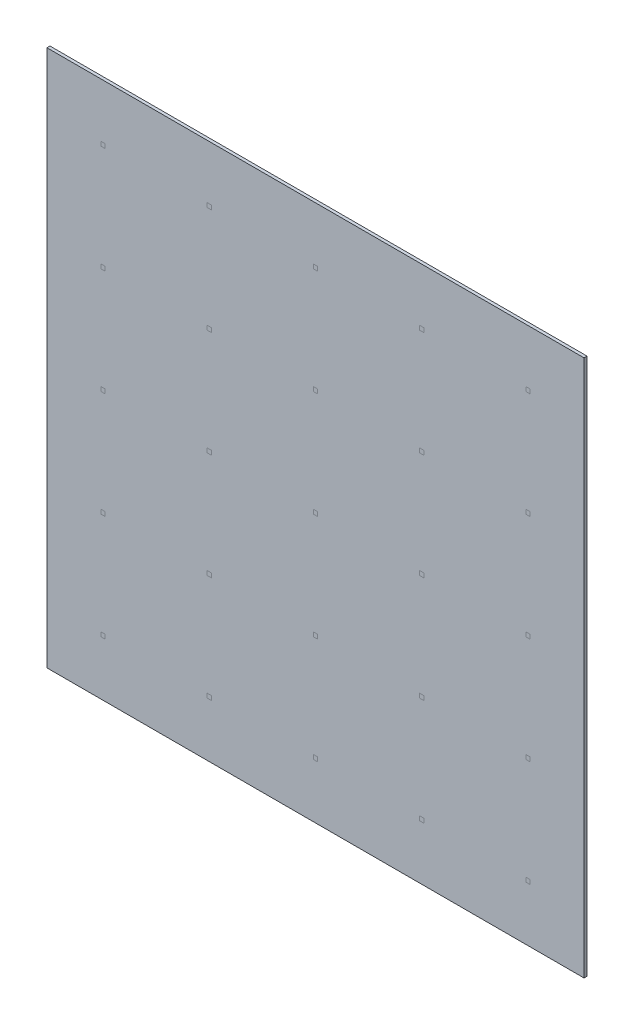
ISO-10303-21;
HEADER;
FILE_DESCRIPTION(('STEP AP214'),'2;1');
FILE_NAME('part.step','',(''),(''),'','','');
FILE_SCHEMA(('AUTOMOTIVE_DESIGN { 1 0 10303 214 1 1 1 1 }'));
ENDSEC;
DATA;
#1=APPLICATION_CONTEXT('core data for automotive mechanical design processes');
#2=APPLICATION_PROTOCOL_DEFINITION('international standard','automotive_design',2000,#1);
#3=PRODUCT_CONTEXT('',#1,'mechanical');
#4=PRODUCT('Part','Part','',(#3));
#5=PRODUCT_RELATED_PRODUCT_CATEGORY('part','',(#4));
#6=PRODUCT_DEFINITION_FORMATION('','',#4);
#7=PRODUCT_DEFINITION_CONTEXT('part definition',#1,'design');
#8=PRODUCT_DEFINITION('design','',#6,#7);
#9=PRODUCT_DEFINITION_SHAPE('','',#8);
#10=(LENGTH_UNIT() NAMED_UNIT(*) SI_UNIT(.MILLI.,.METRE.));
#11=(NAMED_UNIT(*) PLANE_ANGLE_UNIT() SI_UNIT($,.RADIAN.));
#12=(NAMED_UNIT(*) SI_UNIT($,.STERADIAN.) SOLID_ANGLE_UNIT());
#13=UNCERTAINTY_MEASURE_WITH_UNIT(LENGTH_MEASURE(1.E-05),#10,'distance_accuracy_value','');
#14=(GEOMETRIC_REPRESENTATION_CONTEXT(3) GLOBAL_UNCERTAINTY_ASSIGNED_CONTEXT((#13)) GLOBAL_UNIT_ASSIGNED_CONTEXT((#10,
#11,#12)) REPRESENTATION_CONTEXT('',''));
#15=CARTESIAN_POINT('',(0.,0.,0.));
#16=DIRECTION('',(0.,0.,1.));
#17=DIRECTION('',(1.,0.,0.));
#18=AXIS2_PLACEMENT_3D('',#15,#16,#17);
#19=CARTESIAN_POINT('',(0.,0.,0.025));
#20=DIRECTION('',(0.,0.,-1.));
#21=DIRECTION('',(-1.,0.,0.));
#22=AXIS2_PLACEMENT_3D('',#19,#20,#21);
#23=PLANE('',#22);
#24=DIRECTION('',(-1.,0.,0.));
#25=VECTOR('',#24,1.);
#26=CARTESIAN_POINT('',(0.,3.977765814,0.025));
#27=LINE('',#26,#25);
#28=CARTESIAN_POINT('',(3.09776581399999,3.977765814,0.025));
#29=VERTEX_POINT('',#28);
#30=CARTESIAN_POINT('',(3.06223418599999,3.977765814,0.025));
#31=VERTEX_POINT('',#30);
#32=EDGE_CURVE('E711',#29,#31,#27,.T.);
#33=ORIENTED_EDGE('',*,*,#32,.F.);
#34=DIRECTION('',(0.,1.,0.));
#35=VECTOR('',#34,1.);
#36=CARTESIAN_POINT('',(3.09776581399999,0.,0.025));
#37=LINE('',#36,#35);
#38=CARTESIAN_POINT('',(3.09776581399999,3.942234186,0.025));
#39=VERTEX_POINT('',#38);
#40=EDGE_CURVE('E701',#39,#29,#37,.T.);
#41=ORIENTED_EDGE('',*,*,#40,.F.);
#42=DIRECTION('',(1.,0.,0.));
#43=VECTOR('',#42,1.);
#44=CARTESIAN_POINT('',(0.,3.942234186,0.025));
#45=LINE('',#44,#43);
#46=CARTESIAN_POINT('',(3.06223418599999,3.942234186,0.025));
#47=VERTEX_POINT('',#46);
#48=EDGE_CURVE('E717',#47,#39,#45,.T.);
#49=ORIENTED_EDGE('',*,*,#48,.F.);
#50=DIRECTION('',(0.,-1.,0.));
#51=VECTOR('',#50,1.);
#52=CARTESIAN_POINT('',(3.06223418599999,0.,0.025));
#53=LINE('',#52,#51);
#54=EDGE_CURVE('E714',#31,#47,#53,.T.);
#55=ORIENTED_EDGE('',*,*,#54,.F.);
#56=EDGE_LOOP('',(#33,#41,#49,#55));
#57=FACE_BOUND('',#56,.T.);
#58=DIRECTION('',(-1.,0.,0.));
#59=VECTOR('',#58,1.);
#60=CARTESIAN_POINT('',(0.,3.977765814,0.025));
#61=LINE('',#60,#59);
#62=CARTESIAN_POINT('',(1.33776581399999,3.977765814,0.025));
#63=VERTEX_POINT('',#62);
#64=CARTESIAN_POINT('',(1.30223418599999,3.977765814,0.025));
#65=VERTEX_POINT('',#64);
#66=EDGE_CURVE('E685',#63,#65,#61,.T.);
#67=ORIENTED_EDGE('',*,*,#66,.F.);
#68=DIRECTION('',(0.,1.,0.));
#69=VECTOR('',#68,1.);
#70=CARTESIAN_POINT('',(1.33776581399999,0.,0.025));
#71=LINE('',#70,#69);
#72=CARTESIAN_POINT('',(1.33776581399999,3.942234186,0.025));
#73=VERTEX_POINT('',#72);
#74=EDGE_CURVE('E675',#73,#63,#71,.T.);
#75=ORIENTED_EDGE('',*,*,#74,.F.);
#76=DIRECTION('',(1.,0.,0.));
#77=VECTOR('',#76,1.);
#78=CARTESIAN_POINT('',(0.,3.942234186,0.025));
#79=LINE('',#78,#77);
#80=CARTESIAN_POINT('',(1.30223418599999,3.942234186,0.025));
#81=VERTEX_POINT('',#80);
#82=EDGE_CURVE('E692',#81,#73,#79,.T.);
#83=ORIENTED_EDGE('',*,*,#82,.F.);
#84=DIRECTION('',(0.,-1.,0.));
#85=VECTOR('',#84,1.);
#86=CARTESIAN_POINT('',(1.30223418599999,0.,0.025));
#87=LINE('',#86,#85);
#88=EDGE_CURVE('E689',#65,#81,#87,.T.);
#89=ORIENTED_EDGE('',*,*,#88,.F.);
#90=EDGE_LOOP('',(#67,#75,#83,#89));
#91=FACE_BOUND('',#90,.T.);
#92=DIRECTION('',(-1.,0.,0.));
#93=VECTOR('',#92,1.);
#94=CARTESIAN_POINT('',(0.,3.097765814,0.025));
#95=LINE('',#94,#93);
#96=CARTESIAN_POINT('',(3.97776581399999,3.097765814,0.025));
#97=VERTEX_POINT('',#96);
#98=CARTESIAN_POINT('',(3.94223418599999,3.097765814,0.025));
#99=VERTEX_POINT('',#98);
#100=EDGE_CURVE('E659',#97,#99,#95,.T.);
#101=ORIENTED_EDGE('',*,*,#100,.F.);
#102=DIRECTION('',(0.,1.,0.));
#103=VECTOR('',#102,1.);
#104=CARTESIAN_POINT('',(3.97776581399999,0.,0.025));
#105=LINE('',#104,#103);
#106=CARTESIAN_POINT('',(3.97776581399999,3.062234186,0.025));
#107=VERTEX_POINT('',#106);
#108=EDGE_CURVE('E649',#107,#97,#105,.T.);
#109=ORIENTED_EDGE('',*,*,#108,.F.);
#110=DIRECTION('',(1.,0.,0.));
#111=VECTOR('',#110,1.);
#112=CARTESIAN_POINT('',(0.,3.062234186,0.025));
#113=LINE('',#112,#111);
#114=CARTESIAN_POINT('',(3.94223418599999,3.062234186,0.025));
#115=VERTEX_POINT('',#114);
#116=EDGE_CURVE('E666',#115,#107,#113,.T.);
#117=ORIENTED_EDGE('',*,*,#116,.F.);
#118=DIRECTION('',(0.,-1.,0.));
#119=VECTOR('',#118,1.);
#120=CARTESIAN_POINT('',(3.94223418599999,0.,0.025));
#121=LINE('',#120,#119);
#122=EDGE_CURVE('E663',#99,#115,#121,.T.);
#123=ORIENTED_EDGE('',*,*,#122,.F.);
#124=EDGE_LOOP('',(#101,#109,#117,#123));
#125=FACE_BOUND('',#124,.T.);
#126=DIRECTION('',(-1.,0.,0.));
#127=VECTOR('',#126,1.);
#128=CARTESIAN_POINT('',(0.,3.097765814,0.025));
#129=LINE('',#128,#127);
#130=CARTESIAN_POINT('',(2.21776581399999,3.097765814,0.025));
#131=VERTEX_POINT('',#130);
#132=CARTESIAN_POINT('',(2.18223418599999,3.097765814,0.025));
#133=VERTEX_POINT('',#132);
#134=EDGE_CURVE('E633',#131,#133,#129,.T.);
#135=ORIENTED_EDGE('',*,*,#134,.F.);
#136=DIRECTION('',(0.,1.,0.));
#137=VECTOR('',#136,1.);
#138=CARTESIAN_POINT('',(2.21776581399999,0.,0.025));
#139=LINE('',#138,#137);
#140=CARTESIAN_POINT('',(2.21776581399999,3.062234186,0.025));
#141=VERTEX_POINT('',#140);
#142=EDGE_CURVE('E623',#141,#131,#139,.T.);
#143=ORIENTED_EDGE('',*,*,#142,.F.);
#144=DIRECTION('',(1.,0.,0.));
#145=VECTOR('',#144,1.);
#146=CARTESIAN_POINT('',(0.,3.062234186,0.025));
#147=LINE('',#146,#145);
#148=CARTESIAN_POINT('',(2.18223418599999,3.062234186,0.025));
#149=VERTEX_POINT('',#148);
#150=EDGE_CURVE('E640',#149,#141,#147,.T.);
#151=ORIENTED_EDGE('',*,*,#150,.F.);
#152=DIRECTION('',(0.,-1.,0.));
#153=VECTOR('',#152,1.);
#154=CARTESIAN_POINT('',(2.18223418599999,0.,0.025));
#155=LINE('',#154,#153);
#156=EDGE_CURVE('E637',#133,#149,#155,.T.);
#157=ORIENTED_EDGE('',*,*,#156,.F.);
#158=EDGE_LOOP('',(#135,#143,#151,#157));
#159=FACE_BOUND('',#158,.T.);
#160=DIRECTION('',(-1.,0.,0.));
#161=VECTOR('',#160,1.);
#162=CARTESIAN_POINT('',(0.,3.097765814,0.025));
#163=LINE('',#162,#161);
#164=CARTESIAN_POINT('',(0.457765813999991,3.097765814,0.025));
#165=VERTEX_POINT('',#164);
#166=CARTESIAN_POINT('',(0.422234185999991,3.097765814,0.025));
#167=VERTEX_POINT('',#166);
#168=EDGE_CURVE('E607',#165,#167,#163,.T.);
#169=ORIENTED_EDGE('',*,*,#168,.F.);
#170=DIRECTION('',(0.,1.,0.));
#171=VECTOR('',#170,1.);
#172=CARTESIAN_POINT('',(0.457765813999991,0.,0.025));
#173=LINE('',#172,#171);
#174=CARTESIAN_POINT('',(0.457765813999991,3.062234186,0.025));
#175=VERTEX_POINT('',#174);
#176=EDGE_CURVE('E597',#175,#165,#173,.T.);
#177=ORIENTED_EDGE('',*,*,#176,.F.);
#178=DIRECTION('',(1.,0.,0.));
#179=VECTOR('',#178,1.);
#180=CARTESIAN_POINT('',(0.,3.062234186,0.025));
#181=LINE('',#180,#179);
#182=CARTESIAN_POINT('',(0.422234185999991,3.062234186,0.025));
#183=VERTEX_POINT('',#182);
#184=EDGE_CURVE('E614',#183,#175,#181,.T.);
#185=ORIENTED_EDGE('',*,*,#184,.F.);
#186=DIRECTION('',(0.,-1.,0.));
#187=VECTOR('',#186,1.);
#188=CARTESIAN_POINT('',(0.422234185999991,0.,0.025));
#189=LINE('',#188,#187);
#190=EDGE_CURVE('E611',#167,#183,#189,.T.);
#191=ORIENTED_EDGE('',*,*,#190,.F.);
#192=EDGE_LOOP('',(#169,#177,#185,#191));
#193=FACE_BOUND('',#192,.T.);
#194=DIRECTION('',(-1.,0.,0.));
#195=VECTOR('',#194,1.);
#196=CARTESIAN_POINT('',(0.,2.217765814,0.025));
#197=LINE('',#196,#195);
#198=CARTESIAN_POINT('',(3.09776581399999,2.217765814,0.025));
#199=VERTEX_POINT('',#198);
#200=CARTESIAN_POINT('',(3.06223418599999,2.217765814,0.025));
#201=VERTEX_POINT('',#200);
#202=EDGE_CURVE('E581',#199,#201,#197,.T.);
#203=ORIENTED_EDGE('',*,*,#202,.F.);
#204=DIRECTION('',(0.,1.,0.));
#205=VECTOR('',#204,1.);
#206=CARTESIAN_POINT('',(3.09776581399999,0.,0.025));
#207=LINE('',#206,#205);
#208=CARTESIAN_POINT('',(3.09776581399999,2.182234186,0.025));
#209=VERTEX_POINT('',#208);
#210=EDGE_CURVE('E571',#209,#199,#207,.T.);
#211=ORIENTED_EDGE('',*,*,#210,.F.);
#212=DIRECTION('',(1.,0.,0.));
#213=VECTOR('',#212,1.);
#214=CARTESIAN_POINT('',(0.,2.182234186,0.025));
#215=LINE('',#214,#213);
#216=CARTESIAN_POINT('',(3.06223418599999,2.182234186,0.025));
#217=VERTEX_POINT('',#216);
#218=EDGE_CURVE('E588',#217,#209,#215,.T.);
#219=ORIENTED_EDGE('',*,*,#218,.F.);
#220=DIRECTION('',(0.,-1.,0.));
#221=VECTOR('',#220,1.);
#222=CARTESIAN_POINT('',(3.06223418599999,0.,0.025));
#223=LINE('',#222,#221);
#224=EDGE_CURVE('E585',#201,#217,#223,.T.);
#225=ORIENTED_EDGE('',*,*,#224,.F.);
#226=EDGE_LOOP('',(#203,#211,#219,#225));
#227=FACE_BOUND('',#226,.T.);
#228=DIRECTION('',(-1.,0.,0.));
#229=VECTOR('',#228,1.);
#230=CARTESIAN_POINT('',(0.,2.217765814,0.025));
#231=LINE('',#230,#229);
#232=CARTESIAN_POINT('',(1.33776581399999,2.217765814,0.025));
#233=VERTEX_POINT('',#232);
#234=CARTESIAN_POINT('',(1.30223418599999,2.217765814,0.025));
#235=VERTEX_POINT('',#234);
#236=EDGE_CURVE('E555',#233,#235,#231,.T.);
#237=ORIENTED_EDGE('',*,*,#236,.F.);
#238=DIRECTION('',(0.,1.,0.));
#239=VECTOR('',#238,1.);
#240=CARTESIAN_POINT('',(1.33776581399999,0.,0.025));
#241=LINE('',#240,#239);
#242=CARTESIAN_POINT('',(1.33776581399999,2.182234186,0.025));
#243=VERTEX_POINT('',#242);
#244=EDGE_CURVE('E545',#243,#233,#241,.T.);
#245=ORIENTED_EDGE('',*,*,#244,.F.);
#246=DIRECTION('',(1.,0.,0.));
#247=VECTOR('',#246,1.);
#248=CARTESIAN_POINT('',(0.,2.182234186,0.025));
#249=LINE('',#248,#247);
#250=CARTESIAN_POINT('',(1.30223418599999,2.182234186,0.025));
#251=VERTEX_POINT('',#250);
#252=EDGE_CURVE('E562',#251,#243,#249,.T.);
#253=ORIENTED_EDGE('',*,*,#252,.F.);
#254=DIRECTION('',(0.,-1.,0.));
#255=VECTOR('',#254,1.);
#256=CARTESIAN_POINT('',(1.30223418599999,0.,0.025));
#257=LINE('',#256,#255);
#258=EDGE_CURVE('E559',#235,#251,#257,.T.);
#259=ORIENTED_EDGE('',*,*,#258,.F.);
#260=EDGE_LOOP('',(#237,#245,#253,#259));
#261=FACE_BOUND('',#260,.T.);
#262=DIRECTION('',(-1.,0.,0.));
#263=VECTOR('',#262,1.);
#264=CARTESIAN_POINT('',(0.,1.337765814,0.025));
#265=LINE('',#264,#263);
#266=CARTESIAN_POINT('',(3.977765814,1.337765814,0.025));
#267=VERTEX_POINT('',#266);
#268=CARTESIAN_POINT('',(3.942234186,1.337765814,0.025));
#269=VERTEX_POINT('',#268);
#270=EDGE_CURVE('E529',#267,#269,#265,.T.);
#271=ORIENTED_EDGE('',*,*,#270,.F.);
#272=DIRECTION('',(0.,1.,0.));
#273=VECTOR('',#272,1.);
#274=CARTESIAN_POINT('',(3.977765814,0.,0.025));
#275=LINE('',#274,#273);
#276=CARTESIAN_POINT('',(3.977765814,1.302234186,0.025));
#277=VERTEX_POINT('',#276);
#278=EDGE_CURVE('E519',#277,#267,#275,.T.);
#279=ORIENTED_EDGE('',*,*,#278,.F.);
#280=DIRECTION('',(1.,0.,0.));
#281=VECTOR('',#280,1.);
#282=CARTESIAN_POINT('',(0.,1.302234186,0.025));
#283=LINE('',#282,#281);
#284=CARTESIAN_POINT('',(3.942234186,1.302234186,0.025));
#285=VERTEX_POINT('',#284);
#286=EDGE_CURVE('E536',#285,#277,#283,.T.);
#287=ORIENTED_EDGE('',*,*,#286,.F.);
#288=DIRECTION('',(0.,-1.,0.));
#289=VECTOR('',#288,1.);
#290=CARTESIAN_POINT('',(3.942234186,0.,0.025));
#291=LINE('',#290,#289);
#292=EDGE_CURVE('E533',#269,#285,#291,.T.);
#293=ORIENTED_EDGE('',*,*,#292,.F.);
#294=EDGE_LOOP('',(#271,#279,#287,#293));
#295=FACE_BOUND('',#294,.T.);
#296=DIRECTION('',(-1.,0.,0.));
#297=VECTOR('',#296,1.);
#298=CARTESIAN_POINT('',(0.,1.337765814,0.025));
#299=LINE('',#298,#297);
#300=CARTESIAN_POINT('',(2.217765814,1.337765814,0.025));
#301=VERTEX_POINT('',#300);
#302=CARTESIAN_POINT('',(2.182234186,1.337765814,0.025));
#303=VERTEX_POINT('',#302);
#304=EDGE_CURVE('E503',#301,#303,#299,.T.);
#305=ORIENTED_EDGE('',*,*,#304,.F.);
#306=DIRECTION('',(0.,1.,0.));
#307=VECTOR('',#306,1.);
#308=CARTESIAN_POINT('',(2.217765814,0.,0.025));
#309=LINE('',#308,#307);
#310=CARTESIAN_POINT('',(2.217765814,1.302234186,0.025));
#311=VERTEX_POINT('',#310);
#312=EDGE_CURVE('E493',#311,#301,#309,.T.);
#313=ORIENTED_EDGE('',*,*,#312,.F.);
#314=DIRECTION('',(1.,0.,0.));
#315=VECTOR('',#314,1.);
#316=CARTESIAN_POINT('',(0.,1.302234186,0.025));
#317=LINE('',#316,#315);
#318=CARTESIAN_POINT('',(2.182234186,1.302234186,0.025));
#319=VERTEX_POINT('',#318);
#320=EDGE_CURVE('E510',#319,#311,#317,.T.);
#321=ORIENTED_EDGE('',*,*,#320,.F.);
#322=DIRECTION('',(0.,-1.,0.));
#323=VECTOR('',#322,1.);
#324=CARTESIAN_POINT('',(2.182234186,0.,0.025));
#325=LINE('',#324,#323);
#326=EDGE_CURVE('E507',#303,#319,#325,.T.);
#327=ORIENTED_EDGE('',*,*,#326,.F.);
#328=EDGE_LOOP('',(#305,#313,#321,#327));
#329=FACE_BOUND('',#328,.T.);
#330=DIRECTION('',(-1.,0.,0.));
#331=VECTOR('',#330,1.);
#332=CARTESIAN_POINT('',(0.,0.457765814,0.025));
#333=LINE('',#332,#331);
#334=CARTESIAN_POINT('',(3.097765814,0.457765814,0.025));
#335=VERTEX_POINT('',#334);
#336=CARTESIAN_POINT('',(3.062234186,0.457765814,0.025));
#337=VERTEX_POINT('',#336);
#338=EDGE_CURVE('E486',#335,#337,#333,.T.);
#339=ORIENTED_EDGE('',*,*,#338,.F.);
#340=DIRECTION('',(0.,1.,0.));
#341=VECTOR('',#340,1.);
#342=CARTESIAN_POINT('',(3.097765814,0.,0.025));
#343=LINE('',#342,#341);
#344=CARTESIAN_POINT('',(3.097765814,0.422234186,0.025));
#345=VERTEX_POINT('',#344);
#346=EDGE_CURVE('E476',#345,#335,#343,.T.);
#347=ORIENTED_EDGE('',*,*,#346,.F.);
#348=DIRECTION('',(1.,0.,0.));
#349=VECTOR('',#348,1.);
#350=CARTESIAN_POINT('',(0.,0.422234186,0.025));
#351=LINE('',#350,#349);
#352=CARTESIAN_POINT('',(3.062234186,0.422234186,0.025));
#353=VERTEX_POINT('',#352);
#354=EDGE_CURVE('E480',#353,#345,#351,.T.);
#355=ORIENTED_EDGE('',*,*,#354,.F.);
#356=DIRECTION('',(0.,-1.,0.));
#357=VECTOR('',#356,1.);
#358=CARTESIAN_POINT('',(3.062234186,0.,0.025));
#359=LINE('',#358,#357);
#360=EDGE_CURVE('E483',#337,#353,#359,.T.);
#361=ORIENTED_EDGE('',*,*,#360,.F.);
#362=EDGE_LOOP('',(#339,#347,#355,#361));
#363=FACE_BOUND('',#362,.T.);
#364=DIRECTION('',(-1.,0.,0.));
#365=VECTOR('',#364,1.);
#366=CARTESIAN_POINT('',(0.,1.337765814,0.025));
#367=LINE('',#366,#365);
#368=CARTESIAN_POINT('',(1.337765814,1.337765814,0.025));
#369=VERTEX_POINT('',#368);
#370=CARTESIAN_POINT('',(1.302234186,1.337765814,0.025));
#371=VERTEX_POINT('',#370);
#372=EDGE_CURVE('E460',#369,#371,#367,.T.);
#373=ORIENTED_EDGE('',*,*,#372,.F.);
#374=DIRECTION('',(0.,1.,0.));
#375=VECTOR('',#374,1.);
#376=CARTESIAN_POINT('',(1.337765814,0.,0.025));
#377=LINE('',#376,#375);
#378=CARTESIAN_POINT('',(1.337765814,1.302234186,0.025));
#379=VERTEX_POINT('',#378);
#380=EDGE_CURVE('E450',#379,#369,#377,.T.);
#381=ORIENTED_EDGE('',*,*,#380,.F.);
#382=DIRECTION('',(1.,0.,0.));
#383=VECTOR('',#382,1.);
#384=CARTESIAN_POINT('',(0.,1.302234186,0.025));
#385=LINE('',#384,#383);
#386=CARTESIAN_POINT('',(1.302234186,1.302234186,0.025));
#387=VERTEX_POINT('',#386);
#388=EDGE_CURVE('E454',#387,#379,#385,.T.);
#389=ORIENTED_EDGE('',*,*,#388,.F.);
#390=DIRECTION('',(0.,-1.,0.));
#391=VECTOR('',#390,1.);
#392=CARTESIAN_POINT('',(1.302234186,0.,0.025));
#393=LINE('',#392,#391);
#394=EDGE_CURVE('E457',#371,#387,#393,.T.);
#395=ORIENTED_EDGE('',*,*,#394,.F.);
#396=EDGE_LOOP('',(#373,#381,#389,#395));
#397=FACE_BOUND('',#396,.T.);
#398=DIRECTION('',(-1.,0.,0.));
#399=VECTOR('',#398,1.);
#400=CARTESIAN_POINT('',(0.,0.457765814,0.025));
#401=LINE('',#400,#399);
#402=CARTESIAN_POINT('',(2.217765814,0.457765814,0.025));
#403=VERTEX_POINT('',#402);
#404=CARTESIAN_POINT('',(2.182234186,0.457765814,0.025));
#405=VERTEX_POINT('',#404);
#406=EDGE_CURVE('E434',#403,#405,#401,.T.);
#407=ORIENTED_EDGE('',*,*,#406,.F.);
#408=DIRECTION('',(0.,1.,0.));
#409=VECTOR('',#408,1.);
#410=CARTESIAN_POINT('',(2.217765814,0.,0.025));
#411=LINE('',#410,#409);
#412=CARTESIAN_POINT('',(2.217765814,0.422234186,0.025));
#413=VERTEX_POINT('',#412);
#414=EDGE_CURVE('E424',#413,#403,#411,.T.);
#415=ORIENTED_EDGE('',*,*,#414,.F.);
#416=DIRECTION('',(1.,0.,0.));
#417=VECTOR('',#416,1.);
#418=CARTESIAN_POINT('',(0.,0.422234186,0.025));
#419=LINE('',#418,#417);
#420=CARTESIAN_POINT('',(2.182234186,0.422234186,0.025));
#421=VERTEX_POINT('',#420);
#422=EDGE_CURVE('E428',#421,#413,#419,.T.);
#423=ORIENTED_EDGE('',*,*,#422,.F.);
#424=DIRECTION('',(0.,-1.,0.));
#425=VECTOR('',#424,1.);
#426=CARTESIAN_POINT('',(2.182234186,0.,0.025));
#427=LINE('',#426,#425);
#428=EDGE_CURVE('E431',#405,#421,#427,.T.);
#429=ORIENTED_EDGE('',*,*,#428,.F.);
#430=EDGE_LOOP('',(#407,#415,#423,#429));
#431=FACE_BOUND('',#430,.T.);
#432=DIRECTION('',(0.,1.,0.));
#433=VECTOR('',#432,1.);
#434=CARTESIAN_POINT('',(4.425,-0.0250000000000027,0.025));
#435=LINE('',#434,#433);
#436=CARTESIAN_POINT('',(4.425,-0.0250000000000027,0.025));
#437=VERTEX_POINT('',#436);
#438=CARTESIAN_POINT('',(4.425,4.42499999999999,0.025));
#439=VERTEX_POINT('',#438);
#440=EDGE_CURVE('E393',#437,#439,#435,.T.);
#441=ORIENTED_EDGE('',*,*,#440,.T.);
#442=DIRECTION('',(-1.,0.,0.));
#443=VECTOR('',#442,1.);
#444=CARTESIAN_POINT('',(-0.0249999999999993,4.42499999999999,0.025));
#445=LINE('',#444,#443);
#446=CARTESIAN_POINT('',(-0.0249999999999993,4.42499999999999,0.025));
#447=VERTEX_POINT('',#446);
#448=EDGE_CURVE('E382',#439,#447,#445,.T.);
#449=ORIENTED_EDGE('',*,*,#448,.T.);
#450=DIRECTION('',(0.,-1.,0.));
#451=VECTOR('',#450,1.);
#452=CARTESIAN_POINT('',(-0.0249999999999993,-0.0250000000000035,0.025));
#453=LINE('',#452,#451);
#454=CARTESIAN_POINT('',(-0.0249999999999993,-0.0250000000000035,0.025));
#455=VERTEX_POINT('',#454);
#456=EDGE_CURVE('E392',#447,#455,#453,.T.);
#457=ORIENTED_EDGE('',*,*,#456,.T.);
#458=DIRECTION('',(1.,0.,0.));
#459=VECTOR('',#458,1.);
#460=CARTESIAN_POINT('',(-0.0249999999999993,-0.0250000000000035,0.025));
#461=LINE('',#460,#459);
#462=EDGE_CURVE('E398',#455,#437,#461,.T.);
#463=ORIENTED_EDGE('',*,*,#462,.T.);
#464=EDGE_LOOP('',(#441,#449,#457,#463));
#465=FACE_BOUND('',#464,.T.);
#466=DIRECTION('',(0.,1.,0.));
#467=VECTOR('',#466,1.);
#468=CARTESIAN_POINT('',(0.457765814,0.,0.025));
#469=LINE('',#468,#467);
#470=CARTESIAN_POINT('',(0.457765814,0.422234186,0.025));
#471=VERTEX_POINT('',#470);
#472=CARTESIAN_POINT('',(0.457765814,0.457765814,0.025));
#473=VERTEX_POINT('',#472);
#474=EDGE_CURVE('E421',#471,#473,#469,.T.);
#475=ORIENTED_EDGE('',*,*,#474,.F.);
#476=DIRECTION('',(1.,0.,0.));
#477=VECTOR('',#476,1.);
#478=CARTESIAN_POINT('',(0.,0.422234186,0.025));
#479=LINE('',#478,#477);
#480=CARTESIAN_POINT('',(0.422234186,0.422234186,0.025));
#481=VERTEX_POINT('',#480);
#482=EDGE_CURVE('E406',#481,#471,#479,.T.);
#483=ORIENTED_EDGE('',*,*,#482,.F.);
#484=DIRECTION('',(0.,-1.,0.));
#485=VECTOR('',#484,1.);
#486=CARTESIAN_POINT('',(0.422234186,0.,0.025));
#487=LINE('',#486,#485);
#488=CARTESIAN_POINT('',(0.422234186,0.457765814,0.025));
#489=VERTEX_POINT('',#488);
#490=EDGE_CURVE('E410',#489,#481,#487,.T.);
#491=ORIENTED_EDGE('',*,*,#490,.F.);
#492=DIRECTION('',(-1.,0.,0.));
#493=VECTOR('',#492,1.);
#494=CARTESIAN_POINT('',(0.,0.457765814,0.025));
#495=LINE('',#494,#493);
#496=EDGE_CURVE('E418',#473,#489,#495,.T.);
#497=ORIENTED_EDGE('',*,*,#496,.F.);
#498=EDGE_LOOP('',(#475,#483,#491,#497));
#499=FACE_BOUND('',#498,.T.);
#500=DIRECTION('',(-1.,0.,0.));
#501=VECTOR('',#500,1.);
#502=CARTESIAN_POINT('',(0.,0.457765814,0.025));
#503=LINE('',#502,#501);
#504=CARTESIAN_POINT('',(1.337765814,0.457765814,0.025));
#505=VERTEX_POINT('',#504);
#506=CARTESIAN_POINT('',(1.302234186,0.457765814,0.025));
#507=VERTEX_POINT('',#506);
#508=EDGE_CURVE('E447',#505,#507,#503,.T.);
#509=ORIENTED_EDGE('',*,*,#508,.F.);
#510=DIRECTION('',(0.,1.,0.));
#511=VECTOR('',#510,1.);
#512=CARTESIAN_POINT('',(1.337765814,0.,0.025));
#513=LINE('',#512,#511);
#514=CARTESIAN_POINT('',(1.337765814,0.422234186,0.025));
#515=VERTEX_POINT('',#514);
#516=EDGE_CURVE('E437',#515,#505,#513,.T.);
#517=ORIENTED_EDGE('',*,*,#516,.F.);
#518=DIRECTION('',(1.,0.,0.));
#519=VECTOR('',#518,1.);
#520=CARTESIAN_POINT('',(0.,0.422234186,0.025));
#521=LINE('',#520,#519);
#522=CARTESIAN_POINT('',(1.302234186,0.422234186,0.025));
#523=VERTEX_POINT('',#522);
#524=EDGE_CURVE('E441',#523,#515,#521,.T.);
#525=ORIENTED_EDGE('',*,*,#524,.F.);
#526=DIRECTION('',(0.,-1.,0.));
#527=VECTOR('',#526,1.);
#528=CARTESIAN_POINT('',(1.302234186,0.,0.025));
#529=LINE('',#528,#527);
#530=EDGE_CURVE('E444',#507,#523,#529,.T.);
#531=ORIENTED_EDGE('',*,*,#530,.F.);
#532=EDGE_LOOP('',(#509,#517,#525,#531));
#533=FACE_BOUND('',#532,.T.);
#534=DIRECTION('',(-1.,0.,0.));
#535=VECTOR('',#534,1.);
#536=CARTESIAN_POINT('',(0.,1.337765814,0.025));
#537=LINE('',#536,#535);
#538=CARTESIAN_POINT('',(0.457765813999997,1.337765814,0.025));
#539=VERTEX_POINT('',#538);
#540=CARTESIAN_POINT('',(0.422234185999997,1.337765814,0.025));
#541=VERTEX_POINT('',#540);
#542=EDGE_CURVE('E473',#539,#541,#537,.T.);
#543=ORIENTED_EDGE('',*,*,#542,.F.);
#544=DIRECTION('',(0.,1.,0.));
#545=VECTOR('',#544,1.);
#546=CARTESIAN_POINT('',(0.457765813999997,0.,0.025));
#547=LINE('',#546,#545);
#548=CARTESIAN_POINT('',(0.457765813999997,1.302234186,0.025));
#549=VERTEX_POINT('',#548);
#550=EDGE_CURVE('E463',#549,#539,#547,.T.);
#551=ORIENTED_EDGE('',*,*,#550,.F.);
#552=DIRECTION('',(1.,0.,0.));
#553=VECTOR('',#552,1.);
#554=CARTESIAN_POINT('',(0.,1.302234186,0.025));
#555=LINE('',#554,#553);
#556=CARTESIAN_POINT('',(0.422234185999997,1.302234186,0.025));
#557=VERTEX_POINT('',#556);
#558=EDGE_CURVE('E467',#557,#549,#555,.T.);
#559=ORIENTED_EDGE('',*,*,#558,.F.);
#560=DIRECTION('',(0.,-1.,0.));
#561=VECTOR('',#560,1.);
#562=CARTESIAN_POINT('',(0.422234185999997,0.,0.025));
#563=LINE('',#562,#561);
#564=EDGE_CURVE('E470',#541,#557,#563,.T.);
#565=ORIENTED_EDGE('',*,*,#564,.F.);
#566=EDGE_LOOP('',(#543,#551,#559,#565));
#567=FACE_BOUND('',#566,.T.);
#568=DIRECTION('',(-1.,0.,0.));
#569=VECTOR('',#568,1.);
#570=CARTESIAN_POINT('',(0.,0.457765814,0.025));
#571=LINE('',#570,#569);
#572=CARTESIAN_POINT('',(3.977765814,0.457765814,0.025));
#573=VERTEX_POINT('',#572);
#574=CARTESIAN_POINT('',(3.942234186,0.457765814,0.025));
#575=VERTEX_POINT('',#574);
#576=EDGE_CURVE('E490',#573,#575,#571,.T.);
#577=ORIENTED_EDGE('',*,*,#576,.F.);
#578=DIRECTION('',(0.,1.,0.));
#579=VECTOR('',#578,1.);
#580=CARTESIAN_POINT('',(3.977765814,0.,0.025));
#581=LINE('',#580,#579);
#582=CARTESIAN_POINT('',(3.977765814,0.422234186,0.025));
#583=VERTEX_POINT('',#582);
#584=EDGE_CURVE('E489',#583,#573,#581,.T.);
#585=ORIENTED_EDGE('',*,*,#584,.F.);
#586=DIRECTION('',(1.,0.,0.));
#587=VECTOR('',#586,1.);
#588=CARTESIAN_POINT('',(0.,0.422234186,0.025));
#589=LINE('',#588,#587);
#590=CARTESIAN_POINT('',(3.942234186,0.422234186,0.025));
#591=VERTEX_POINT('',#590);
#592=EDGE_CURVE('E497',#591,#583,#589,.T.);
#593=ORIENTED_EDGE('',*,*,#592,.F.);
#594=DIRECTION('',(0.,-1.,0.));
#595=VECTOR('',#594,1.);
#596=CARTESIAN_POINT('',(3.942234186,0.,0.025));
#597=LINE('',#596,#595);
#598=EDGE_CURVE('E494',#575,#591,#597,.T.);
#599=ORIENTED_EDGE('',*,*,#598,.F.);
#600=EDGE_LOOP('',(#577,#585,#593,#599));
#601=FACE_BOUND('',#600,.T.);
#602=DIRECTION('',(-1.,0.,0.));
#603=VECTOR('',#602,1.);
#604=CARTESIAN_POINT('',(0.,1.337765814,0.025));
#605=LINE('',#604,#603);
#606=CARTESIAN_POINT('',(3.097765814,1.337765814,0.025));
#607=VERTEX_POINT('',#606);
#608=CARTESIAN_POINT('',(3.062234186,1.337765814,0.025));
#609=VERTEX_POINT('',#608);
#610=EDGE_CURVE('E516',#607,#609,#605,.T.);
#611=ORIENTED_EDGE('',*,*,#610,.F.);
#612=DIRECTION('',(0.,1.,0.));
#613=VECTOR('',#612,1.);
#614=CARTESIAN_POINT('',(3.097765814,0.,0.025));
#615=LINE('',#614,#613);
#616=CARTESIAN_POINT('',(3.097765814,1.302234186,0.025));
#617=VERTEX_POINT('',#616);
#618=EDGE_CURVE('E506',#617,#607,#615,.T.);
#619=ORIENTED_EDGE('',*,*,#618,.F.);
#620=DIRECTION('',(1.,0.,0.));
#621=VECTOR('',#620,1.);
#622=CARTESIAN_POINT('',(0.,1.302234186,0.025));
#623=LINE('',#622,#621);
#624=CARTESIAN_POINT('',(3.062234186,1.302234186,0.025));
#625=VERTEX_POINT('',#624);
#626=EDGE_CURVE('E523',#625,#617,#623,.T.);
#627=ORIENTED_EDGE('',*,*,#626,.F.);
#628=DIRECTION('',(0.,-1.,0.));
#629=VECTOR('',#628,1.);
#630=CARTESIAN_POINT('',(3.062234186,0.,0.025));
#631=LINE('',#630,#629);
#632=EDGE_CURVE('E520',#609,#625,#631,.T.);
#633=ORIENTED_EDGE('',*,*,#632,.F.);
#634=EDGE_LOOP('',(#611,#619,#627,#633));
#635=FACE_BOUND('',#634,.T.);
#636=DIRECTION('',(-1.,0.,0.));
#637=VECTOR('',#636,1.);
#638=CARTESIAN_POINT('',(0.,2.217765814,0.025));
#639=LINE('',#638,#637);
#640=CARTESIAN_POINT('',(0.457765813999994,2.217765814,0.025));
#641=VERTEX_POINT('',#640);
#642=CARTESIAN_POINT('',(0.422234185999994,2.217765814,0.025));
#643=VERTEX_POINT('',#642);
#644=EDGE_CURVE('E542',#641,#643,#639,.T.);
#645=ORIENTED_EDGE('',*,*,#644,.F.);
#646=DIRECTION('',(0.,1.,0.));
#647=VECTOR('',#646,1.);
#648=CARTESIAN_POINT('',(0.457765813999994,0.,0.025));
#649=LINE('',#648,#647);
#650=CARTESIAN_POINT('',(0.457765813999994,2.182234186,0.025));
#651=VERTEX_POINT('',#650);
#652=EDGE_CURVE('E532',#651,#641,#649,.T.);
#653=ORIENTED_EDGE('',*,*,#652,.F.);
#654=DIRECTION('',(1.,0.,0.));
#655=VECTOR('',#654,1.);
#656=CARTESIAN_POINT('',(0.,2.182234186,0.025));
#657=LINE('',#656,#655);
#658=CARTESIAN_POINT('',(0.422234185999994,2.182234186,0.025));
#659=VERTEX_POINT('',#658);
#660=EDGE_CURVE('E549',#659,#651,#657,.T.);
#661=ORIENTED_EDGE('',*,*,#660,.F.);
#662=DIRECTION('',(0.,-1.,0.));
#663=VECTOR('',#662,1.);
#664=CARTESIAN_POINT('',(0.422234185999994,0.,0.025));
#665=LINE('',#664,#663);
#666=EDGE_CURVE('E546',#643,#659,#665,.T.);
#667=ORIENTED_EDGE('',*,*,#666,.F.);
#668=EDGE_LOOP('',(#645,#653,#661,#667));
#669=FACE_BOUND('',#668,.T.);
#670=DIRECTION('',(-1.,0.,0.));
#671=VECTOR('',#670,1.);
#672=CARTESIAN_POINT('',(0.,2.217765814,0.025));
#673=LINE('',#672,#671);
#674=CARTESIAN_POINT('',(2.21776581399999,2.217765814,0.025));
#675=VERTEX_POINT('',#674);
#676=CARTESIAN_POINT('',(2.18223418599999,2.217765814,0.025));
#677=VERTEX_POINT('',#676);
#678=EDGE_CURVE('E568',#675,#677,#673,.T.);
#679=ORIENTED_EDGE('',*,*,#678,.F.);
#680=DIRECTION('',(0.,1.,0.));
#681=VECTOR('',#680,1.);
#682=CARTESIAN_POINT('',(2.21776581399999,0.,0.025));
#683=LINE('',#682,#681);
#684=CARTESIAN_POINT('',(2.21776581399999,2.182234186,0.025));
#685=VERTEX_POINT('',#684);
#686=EDGE_CURVE('E558',#685,#675,#683,.T.);
#687=ORIENTED_EDGE('',*,*,#686,.F.);
#688=DIRECTION('',(1.,0.,0.));
#689=VECTOR('',#688,1.);
#690=CARTESIAN_POINT('',(0.,2.182234186,0.025));
#691=LINE('',#690,#689);
#692=CARTESIAN_POINT('',(2.18223418599999,2.182234186,0.025));
#693=VERTEX_POINT('',#692);
#694=EDGE_CURVE('E575',#693,#685,#691,.T.);
#695=ORIENTED_EDGE('',*,*,#694,.F.);
#696=DIRECTION('',(0.,-1.,0.));
#697=VECTOR('',#696,1.);
#698=CARTESIAN_POINT('',(2.18223418599999,0.,0.025));
#699=LINE('',#698,#697);
#700=EDGE_CURVE('E572',#677,#693,#699,.T.);
#701=ORIENTED_EDGE('',*,*,#700,.F.);
#702=EDGE_LOOP('',(#679,#687,#695,#701));
#703=FACE_BOUND('',#702,.T.);
#704=DIRECTION('',(-1.,0.,0.));
#705=VECTOR('',#704,1.);
#706=CARTESIAN_POINT('',(0.,2.217765814,0.025));
#707=LINE('',#706,#705);
#708=CARTESIAN_POINT('',(3.97776581399999,2.217765814,0.025));
#709=VERTEX_POINT('',#708);
#710=CARTESIAN_POINT('',(3.94223418599999,2.217765814,0.025));
#711=VERTEX_POINT('',#710);
#712=EDGE_CURVE('E594',#709,#711,#707,.T.);
#713=ORIENTED_EDGE('',*,*,#712,.F.);
#714=DIRECTION('',(0.,1.,0.));
#715=VECTOR('',#714,1.);
#716=CARTESIAN_POINT('',(3.97776581399999,0.,0.025));
#717=LINE('',#716,#715);
#718=CARTESIAN_POINT('',(3.97776581399999,2.182234186,0.025));
#719=VERTEX_POINT('',#718);
#720=EDGE_CURVE('E584',#719,#709,#717,.T.);
#721=ORIENTED_EDGE('',*,*,#720,.F.);
#722=DIRECTION('',(1.,0.,0.));
#723=VECTOR('',#722,1.);
#724=CARTESIAN_POINT('',(0.,2.182234186,0.025));
#725=LINE('',#724,#723);
#726=CARTESIAN_POINT('',(3.94223418599999,2.182234186,0.025));
#727=VERTEX_POINT('',#726);
#728=EDGE_CURVE('E601',#727,#719,#725,.T.);
#729=ORIENTED_EDGE('',*,*,#728,.F.);
#730=DIRECTION('',(0.,-1.,0.));
#731=VECTOR('',#730,1.);
#732=CARTESIAN_POINT('',(3.94223418599999,0.,0.025));
#733=LINE('',#732,#731);
#734=EDGE_CURVE('E598',#711,#727,#733,.T.);
#735=ORIENTED_EDGE('',*,*,#734,.F.);
#736=EDGE_LOOP('',(#713,#721,#729,#735));
#737=FACE_BOUND('',#736,.T.);
#738=DIRECTION('',(-1.,0.,0.));
#739=VECTOR('',#738,1.);
#740=CARTESIAN_POINT('',(0.,3.097765814,0.025));
#741=LINE('',#740,#739);
#742=CARTESIAN_POINT('',(1.33776581399999,3.097765814,0.025));
#743=VERTEX_POINT('',#742);
#744=CARTESIAN_POINT('',(1.30223418599999,3.097765814,0.025));
#745=VERTEX_POINT('',#744);
#746=EDGE_CURVE('E620',#743,#745,#741,.T.);
#747=ORIENTED_EDGE('',*,*,#746,.F.);
#748=DIRECTION('',(0.,1.,0.));
#749=VECTOR('',#748,1.);
#750=CARTESIAN_POINT('',(1.33776581399999,0.,0.025));
#751=LINE('',#750,#749);
#752=CARTESIAN_POINT('',(1.33776581399999,3.062234186,0.025));
#753=VERTEX_POINT('',#752);
#754=EDGE_CURVE('E610',#753,#743,#751,.T.);
#755=ORIENTED_EDGE('',*,*,#754,.F.);
#756=DIRECTION('',(1.,0.,0.));
#757=VECTOR('',#756,1.);
#758=CARTESIAN_POINT('',(0.,3.062234186,0.025));
#759=LINE('',#758,#757);
#760=CARTESIAN_POINT('',(1.30223418599999,3.062234186,0.025));
#761=VERTEX_POINT('',#760);
#762=EDGE_CURVE('E627',#761,#753,#759,.T.);
#763=ORIENTED_EDGE('',*,*,#762,.F.);
#764=DIRECTION('',(0.,-1.,0.));
#765=VECTOR('',#764,1.);
#766=CARTESIAN_POINT('',(1.30223418599999,0.,0.025));
#767=LINE('',#766,#765);
#768=EDGE_CURVE('E624',#745,#761,#767,.T.);
#769=ORIENTED_EDGE('',*,*,#768,.F.);
#770=EDGE_LOOP('',(#747,#755,#763,#769));
#771=FACE_BOUND('',#770,.T.);
#772=DIRECTION('',(-1.,0.,0.));
#773=VECTOR('',#772,1.);
#774=CARTESIAN_POINT('',(0.,3.097765814,0.025));
#775=LINE('',#774,#773);
#776=CARTESIAN_POINT('',(3.09776581399999,3.097765814,0.025));
#777=VERTEX_POINT('',#776);
#778=CARTESIAN_POINT('',(3.06223418599999,3.097765814,0.025));
#779=VERTEX_POINT('',#778);
#780=EDGE_CURVE('E646',#777,#779,#775,.T.);
#781=ORIENTED_EDGE('',*,*,#780,.F.);
#782=DIRECTION('',(0.,1.,0.));
#783=VECTOR('',#782,1.);
#784=CARTESIAN_POINT('',(3.09776581399999,0.,0.025));
#785=LINE('',#784,#783);
#786=CARTESIAN_POINT('',(3.09776581399999,3.062234186,0.025));
#787=VERTEX_POINT('',#786);
#788=EDGE_CURVE('E636',#787,#777,#785,.T.);
#789=ORIENTED_EDGE('',*,*,#788,.F.);
#790=DIRECTION('',(1.,0.,0.));
#791=VECTOR('',#790,1.);
#792=CARTESIAN_POINT('',(0.,3.062234186,0.025));
#793=LINE('',#792,#791);
#794=CARTESIAN_POINT('',(3.06223418599999,3.062234186,0.025));
#795=VERTEX_POINT('',#794);
#796=EDGE_CURVE('E653',#795,#787,#793,.T.);
#797=ORIENTED_EDGE('',*,*,#796,.F.);
#798=DIRECTION('',(0.,-1.,0.));
#799=VECTOR('',#798,1.);
#800=CARTESIAN_POINT('',(3.06223418599999,0.,0.025));
#801=LINE('',#800,#799);
#802=EDGE_CURVE('E650',#779,#795,#801,.T.);
#803=ORIENTED_EDGE('',*,*,#802,.F.);
#804=EDGE_LOOP('',(#781,#789,#797,#803));
#805=FACE_BOUND('',#804,.T.);
#806=DIRECTION('',(-1.,0.,0.));
#807=VECTOR('',#806,1.);
#808=CARTESIAN_POINT('',(0.,3.977765814,0.025));
#809=LINE('',#808,#807);
#810=CARTESIAN_POINT('',(0.457765813999988,3.977765814,0.025));
#811=VERTEX_POINT('',#810);
#812=CARTESIAN_POINT('',(0.422234185999988,3.977765814,0.025));
#813=VERTEX_POINT('',#812);
#814=EDGE_CURVE('E672',#811,#813,#809,.T.);
#815=ORIENTED_EDGE('',*,*,#814,.F.);
#816=DIRECTION('',(0.,1.,0.));
#817=VECTOR('',#816,1.);
#818=CARTESIAN_POINT('',(0.457765813999988,0.,0.025));
#819=LINE('',#818,#817);
#820=CARTESIAN_POINT('',(0.457765813999988,3.942234186,0.025));
#821=VERTEX_POINT('',#820);
#822=EDGE_CURVE('E662',#821,#811,#819,.T.);
#823=ORIENTED_EDGE('',*,*,#822,.F.);
#824=DIRECTION('',(1.,0.,0.));
#825=VECTOR('',#824,1.);
#826=CARTESIAN_POINT('',(0.,3.942234186,0.025));
#827=LINE('',#826,#825);
#828=CARTESIAN_POINT('',(0.422234185999988,3.942234186,0.025));
#829=VERTEX_POINT('',#828);
#830=EDGE_CURVE('E679',#829,#821,#827,.T.);
#831=ORIENTED_EDGE('',*,*,#830,.F.);
#832=DIRECTION('',(0.,-1.,0.));
#833=VECTOR('',#832,1.);
#834=CARTESIAN_POINT('',(0.422234185999988,0.,0.025));
#835=LINE('',#834,#833);
#836=EDGE_CURVE('E676',#813,#829,#835,.T.);
#837=ORIENTED_EDGE('',*,*,#836,.F.);
#838=EDGE_LOOP('',(#815,#823,#831,#837));
#839=FACE_BOUND('',#838,.T.);
#840=DIRECTION('',(-1.,0.,0.));
#841=VECTOR('',#840,1.);
#842=CARTESIAN_POINT('',(0.,3.977765814,0.025));
#843=LINE('',#842,#841);
#844=CARTESIAN_POINT('',(2.21776581399999,3.977765814,0.025));
#845=VERTEX_POINT('',#844);
#846=CARTESIAN_POINT('',(2.18223418599999,3.977765814,0.025));
#847=VERTEX_POINT('',#846);
#848=EDGE_CURVE('E698',#845,#847,#843,.T.);
#849=ORIENTED_EDGE('',*,*,#848,.F.);
#850=DIRECTION('',(0.,1.,0.));
#851=VECTOR('',#850,1.);
#852=CARTESIAN_POINT('',(2.21776581399999,0.,0.025));
#853=LINE('',#852,#851);
#854=CARTESIAN_POINT('',(2.21776581399999,3.942234186,0.025));
#855=VERTEX_POINT('',#854);
#856=EDGE_CURVE('E688',#855,#845,#853,.T.);
#857=ORIENTED_EDGE('',*,*,#856,.F.);
#858=DIRECTION('',(1.,0.,0.));
#859=VECTOR('',#858,1.);
#860=CARTESIAN_POINT('',(0.,3.942234186,0.025));
#861=LINE('',#860,#859);
#862=CARTESIAN_POINT('',(2.18223418599999,3.942234186,0.025));
#863=VERTEX_POINT('',#862);
#864=EDGE_CURVE('E705',#863,#855,#861,.T.);
#865=ORIENTED_EDGE('',*,*,#864,.F.);
#866=DIRECTION('',(0.,-1.,0.));
#867=VECTOR('',#866,1.);
#868=CARTESIAN_POINT('',(2.18223418599999,0.,0.025));
#869=LINE('',#868,#867);
#870=EDGE_CURVE('E702',#847,#863,#869,.T.);
#871=ORIENTED_EDGE('',*,*,#870,.F.);
#872=EDGE_LOOP('',(#849,#857,#865,#871));
#873=FACE_BOUND('',#872,.T.);
#874=DIRECTION('',(-1.,0.,0.));
#875=VECTOR('',#874,1.);
#876=CARTESIAN_POINT('',(0.,3.977765814,0.025));
#877=LINE('',#876,#875);
#878=CARTESIAN_POINT('',(3.97776581399999,3.977765814,0.025));
#879=VERTEX_POINT('',#878);
#880=CARTESIAN_POINT('',(3.94223418599999,3.977765814,0.025));
#881=VERTEX_POINT('',#880);
#882=EDGE_CURVE('E11',#879,#881,#877,.T.);
#883=ORIENTED_EDGE('',*,*,#882,.F.);
#884=DIRECTION('',(0.,1.,0.));
#885=VECTOR('',#884,1.);
#886=CARTESIAN_POINT('',(3.97776581399999,0.,0.025));
#887=LINE('',#886,#885);
#888=CARTESIAN_POINT('',(3.97776581399999,3.942234186,0.025));
#889=VERTEX_POINT('',#888);
#890=EDGE_CURVE('E47',#889,#879,#887,.T.);
#891=ORIENTED_EDGE('',*,*,#890,.F.);
#892=DIRECTION('',(1.,0.,0.));
#893=VECTOR('',#892,1.);
#894=CARTESIAN_POINT('',(0.,3.942234186,0.025));
#895=LINE('',#894,#893);
#896=CARTESIAN_POINT('',(3.94223418599999,3.942234186,0.025));
#897=VERTEX_POINT('',#896);
#898=EDGE_CURVE('E724',#897,#889,#895,.T.);
#899=ORIENTED_EDGE('',*,*,#898,.F.);
#900=DIRECTION('',(0.,-1.,0.));
#901=VECTOR('',#900,1.);
#902=CARTESIAN_POINT('',(3.94223418599999,0.,0.025));
#903=LINE('',#902,#901);
#904=EDGE_CURVE('E53',#881,#897,#903,.T.);
#905=ORIENTED_EDGE('',*,*,#904,.F.);
#906=EDGE_LOOP('',(#883,#891,#899,#905));
#907=FACE_BOUND('',#906,.T.);
#908=ADVANCED_FACE('F43',(#57,#91,#125,#159,#193,#227,#261,#295,#329,#363,#397,#431,#465,#499,
#533,#567,#601,#635,#669,#703,#737,#771,#805,#839,#873,#907),#23,.F.);
#909=ORIENTED_EDGE('',*,*,#890,.T.);
#910=ORIENTED_EDGE('',*,*,#882,.T.);
#911=ORIENTED_EDGE('',*,*,#904,.T.);
#912=ORIENTED_EDGE('',*,*,#898,.T.);
#913=EDGE_LOOP('',(#909,#910,#911,#912));
#914=FACE_BOUND('',#913,.T.);
#915=ADVANCED_FACE('F732',(#914),#23,.F.);
#916=ORIENTED_EDGE('',*,*,#40,.T.);
#917=ORIENTED_EDGE('',*,*,#32,.T.);
#918=ORIENTED_EDGE('',*,*,#54,.T.);
#919=ORIENTED_EDGE('',*,*,#48,.T.);
#920=EDGE_LOOP('',(#916,#917,#918,#919));
#921=FACE_BOUND('',#920,.T.);
#922=ADVANCED_FACE('F742',(#921),#23,.F.);
#923=ORIENTED_EDGE('',*,*,#856,.T.);
#924=ORIENTED_EDGE('',*,*,#848,.T.);
#925=ORIENTED_EDGE('',*,*,#870,.T.);
#926=ORIENTED_EDGE('',*,*,#864,.T.);
#927=EDGE_LOOP('',(#923,#924,#925,#926));
#928=FACE_BOUND('',#927,.T.);
#929=ADVANCED_FACE('F811',(#928),#23,.F.);
#930=ORIENTED_EDGE('',*,*,#74,.T.);
#931=ORIENTED_EDGE('',*,*,#66,.T.);
#932=ORIENTED_EDGE('',*,*,#88,.T.);
#933=ORIENTED_EDGE('',*,*,#82,.T.);
#934=EDGE_LOOP('',(#930,#931,#932,#933));
#935=FACE_BOUND('',#934,.T.);
#936=ADVANCED_FACE('F813',(#935),#23,.F.);
#937=ORIENTED_EDGE('',*,*,#822,.T.);
#938=ORIENTED_EDGE('',*,*,#814,.T.);
#939=ORIENTED_EDGE('',*,*,#836,.T.);
#940=ORIENTED_EDGE('',*,*,#830,.T.);
#941=EDGE_LOOP('',(#937,#938,#939,#940));
#942=FACE_BOUND('',#941,.T.);
#943=ADVANCED_FACE('F818',(#942),#23,.F.);
#944=ORIENTED_EDGE('',*,*,#108,.T.);
#945=ORIENTED_EDGE('',*,*,#100,.T.);
#946=ORIENTED_EDGE('',*,*,#122,.T.);
#947=ORIENTED_EDGE('',*,*,#116,.T.);
#948=EDGE_LOOP('',(#944,#945,#946,#947));
#949=FACE_BOUND('',#948,.T.);
#950=ADVANCED_FACE('F1043',(#949),#23,.F.);
#951=ORIENTED_EDGE('',*,*,#788,.T.);
#952=ORIENTED_EDGE('',*,*,#780,.T.);
#953=ORIENTED_EDGE('',*,*,#802,.T.);
#954=ORIENTED_EDGE('',*,*,#796,.T.);
#955=EDGE_LOOP('',(#951,#952,#953,#954));
#956=FACE_BOUND('',#955,.T.);
#957=ADVANCED_FACE('F1035',(#956),#23,.F.);
#958=ORIENTED_EDGE('',*,*,#142,.T.);
#959=ORIENTED_EDGE('',*,*,#134,.T.);
#960=ORIENTED_EDGE('',*,*,#156,.T.);
#961=ORIENTED_EDGE('',*,*,#150,.T.);
#962=EDGE_LOOP('',(#958,#959,#960,#961));
#963=FACE_BOUND('',#962,.T.);
#964=ADVANCED_FACE('F1027',(#963),#23,.F.);
#965=ORIENTED_EDGE('',*,*,#754,.T.);
#966=ORIENTED_EDGE('',*,*,#746,.T.);
#967=ORIENTED_EDGE('',*,*,#768,.T.);
#968=ORIENTED_EDGE('',*,*,#762,.T.);
#969=EDGE_LOOP('',(#965,#966,#967,#968));
#970=FACE_BOUND('',#969,.T.);
#971=ADVANCED_FACE('F1019',(#970),#23,.F.);
#972=ORIENTED_EDGE('',*,*,#176,.T.);
#973=ORIENTED_EDGE('',*,*,#168,.T.);
#974=ORIENTED_EDGE('',*,*,#190,.T.);
#975=ORIENTED_EDGE('',*,*,#184,.T.);
#976=EDGE_LOOP('',(#972,#973,#974,#975));
#977=FACE_BOUND('',#976,.T.);
#978=ADVANCED_FACE('F1011',(#977),#23,.F.);
#979=ORIENTED_EDGE('',*,*,#720,.T.);
#980=ORIENTED_EDGE('',*,*,#712,.T.);
#981=ORIENTED_EDGE('',*,*,#734,.T.);
#982=ORIENTED_EDGE('',*,*,#728,.T.);
#983=EDGE_LOOP('',(#979,#980,#981,#982));
#984=FACE_BOUND('',#983,.T.);
#985=ADVANCED_FACE('F1003',(#984),#23,.F.);
#986=ORIENTED_EDGE('',*,*,#210,.T.);
#987=ORIENTED_EDGE('',*,*,#202,.T.);
#988=ORIENTED_EDGE('',*,*,#224,.T.);
#989=ORIENTED_EDGE('',*,*,#218,.T.);
#990=EDGE_LOOP('',(#986,#987,#988,#989));
#991=FACE_BOUND('',#990,.T.);
#992=ADVANCED_FACE('F995',(#991),#23,.F.);
#993=ORIENTED_EDGE('',*,*,#686,.T.);
#994=ORIENTED_EDGE('',*,*,#678,.T.);
#995=ORIENTED_EDGE('',*,*,#700,.T.);
#996=ORIENTED_EDGE('',*,*,#694,.T.);
#997=EDGE_LOOP('',(#993,#994,#995,#996));
#998=FACE_BOUND('',#997,.T.);
#999=ADVANCED_FACE('F987',(#998),#23,.F.);
#1000=ORIENTED_EDGE('',*,*,#244,.T.);
#1001=ORIENTED_EDGE('',*,*,#236,.T.);
#1002=ORIENTED_EDGE('',*,*,#258,.T.);
#1003=ORIENTED_EDGE('',*,*,#252,.T.);
#1004=EDGE_LOOP('',(#1000,#1001,#1002,#1003));
#1005=FACE_BOUND('',#1004,.T.);
#1006=ADVANCED_FACE('F979',(#1005),#23,.F.);
#1007=ORIENTED_EDGE('',*,*,#652,.T.);
#1008=ORIENTED_EDGE('',*,*,#644,.T.);
#1009=ORIENTED_EDGE('',*,*,#666,.T.);
#1010=ORIENTED_EDGE('',*,*,#660,.T.);
#1011=EDGE_LOOP('',(#1007,#1008,#1009,#1010));
#1012=FACE_BOUND('',#1011,.T.);
#1013=ADVANCED_FACE('F971',(#1012),#23,.F.);
#1014=ORIENTED_EDGE('',*,*,#278,.T.);
#1015=ORIENTED_EDGE('',*,*,#270,.T.);
#1016=ORIENTED_EDGE('',*,*,#292,.T.);
#1017=ORIENTED_EDGE('',*,*,#286,.T.);
#1018=EDGE_LOOP('',(#1014,#1015,#1016,#1017));
#1019=FACE_BOUND('',#1018,.T.);
#1020=ADVANCED_FACE('F963',(#1019),#23,.F.);
#1021=ORIENTED_EDGE('',*,*,#618,.T.);
#1022=ORIENTED_EDGE('',*,*,#610,.T.);
#1023=ORIENTED_EDGE('',*,*,#632,.T.);
#1024=ORIENTED_EDGE('',*,*,#626,.T.);
#1025=EDGE_LOOP('',(#1021,#1022,#1023,#1024));
#1026=FACE_BOUND('',#1025,.T.);
#1027=ADVANCED_FACE('F955',(#1026),#23,.F.);
#1028=ORIENTED_EDGE('',*,*,#312,.T.);
#1029=ORIENTED_EDGE('',*,*,#304,.T.);
#1030=ORIENTED_EDGE('',*,*,#326,.T.);
#1031=ORIENTED_EDGE('',*,*,#320,.T.);
#1032=EDGE_LOOP('',(#1028,#1029,#1030,#1031));
#1033=FACE_BOUND('',#1032,.T.);
#1034=ADVANCED_FACE('F947',(#1033),#23,.F.);
#1035=ORIENTED_EDGE('',*,*,#584,.T.);
#1036=ORIENTED_EDGE('',*,*,#576,.T.);
#1037=ORIENTED_EDGE('',*,*,#598,.T.);
#1038=ORIENTED_EDGE('',*,*,#592,.T.);
#1039=EDGE_LOOP('',(#1035,#1036,#1037,#1038));
#1040=FACE_BOUND('',#1039,.T.);
#1041=ADVANCED_FACE('F939',(#1040),#23,.F.);
#1042=ORIENTED_EDGE('',*,*,#346,.T.);
#1043=ORIENTED_EDGE('',*,*,#338,.T.);
#1044=ORIENTED_EDGE('',*,*,#360,.T.);
#1045=ORIENTED_EDGE('',*,*,#354,.T.);
#1046=EDGE_LOOP('',(#1042,#1043,#1044,#1045));
#1047=FACE_BOUND('',#1046,.T.);
#1048=ADVANCED_FACE('F931',(#1047),#23,.F.);
#1049=ORIENTED_EDGE('',*,*,#550,.T.);
#1050=ORIENTED_EDGE('',*,*,#542,.T.);
#1051=ORIENTED_EDGE('',*,*,#564,.T.);
#1052=ORIENTED_EDGE('',*,*,#558,.T.);
#1053=EDGE_LOOP('',(#1049,#1050,#1051,#1052));
#1054=FACE_BOUND('',#1053,.T.);
#1055=ADVANCED_FACE('F773',(#1054),#23,.F.);
#1056=ORIENTED_EDGE('',*,*,#380,.T.);
#1057=ORIENTED_EDGE('',*,*,#372,.T.);
#1058=ORIENTED_EDGE('',*,*,#394,.T.);
#1059=ORIENTED_EDGE('',*,*,#388,.T.);
#1060=EDGE_LOOP('',(#1056,#1057,#1058,#1059));
#1061=FACE_BOUND('',#1060,.T.);
#1062=ADVANCED_FACE('F764',(#1061),#23,.F.);
#1063=ORIENTED_EDGE('',*,*,#516,.T.);
#1064=ORIENTED_EDGE('',*,*,#508,.T.);
#1065=ORIENTED_EDGE('',*,*,#530,.T.);
#1066=ORIENTED_EDGE('',*,*,#524,.T.);
#1067=EDGE_LOOP('',(#1063,#1064,#1065,#1066));
#1068=FACE_BOUND('',#1067,.T.);
#1069=ADVANCED_FACE('F758',(#1068),#23,.F.);
#1070=ORIENTED_EDGE('',*,*,#414,.T.);
#1071=ORIENTED_EDGE('',*,*,#406,.T.);
#1072=ORIENTED_EDGE('',*,*,#428,.T.);
#1073=ORIENTED_EDGE('',*,*,#422,.T.);
#1074=EDGE_LOOP('',(#1070,#1071,#1072,#1073));
#1075=FACE_BOUND('',#1074,.T.);
#1076=ADVANCED_FACE('F749',(#1075),#23,.F.);
#1077=CARTESIAN_POINT('',(4.425,-0.0250000000000027,0.025));
#1078=DIRECTION('',(-1.,0.,0.));
#1079=DIRECTION('',(0.,-1.,0.));
#1080=AXIS2_PLACEMENT_3D('',#1077,#1078,#1079);
#1081=PLANE('',#1080);
#1082=DIRECTION('',(0.,1.,0.));
#1083=VECTOR('',#1082,1.);
#1084=CARTESIAN_POINT('',(4.425,-0.0250000000000027,0.));
#1085=LINE('',#1084,#1083);
#1086=CARTESIAN_POINT('',(4.425,-0.0250000000000027,0.));
#1087=VERTEX_POINT('',#1086);
#1088=CARTESIAN_POINT('',(4.425,4.42499999999999,0.));
#1089=VERTEX_POINT('',#1088);
#1090=EDGE_CURVE('E405',#1087,#1089,#1085,.T.);
#1091=ORIENTED_EDGE('',*,*,#1090,.T.);
#1092=DIRECTION('',(0.,0.,-1.));
#1093=VECTOR('',#1092,1.);
#1094=CARTESIAN_POINT('',(4.425,4.42499999999999,0.025));
#1095=LINE('',#1094,#1093);
#1096=EDGE_CURVE('E386',#439,#1089,#1095,.T.);
#1097=ORIENTED_EDGE('',*,*,#1096,.F.);
#1098=ORIENTED_EDGE('',*,*,#440,.F.);
#1099=DIRECTION('',(0.,0.,-1.));
#1100=VECTOR('',#1099,1.);
#1101=CARTESIAN_POINT('',(4.425,-0.0250000000000027,0.025));
#1102=LINE('',#1101,#1100);
#1103=EDGE_CURVE('E893',#437,#1087,#1102,.T.);
#1104=ORIENTED_EDGE('',*,*,#1103,.T.);
#1105=EDGE_LOOP('',(#1091,#1097,#1098,#1104));
#1106=FACE_BOUND('',#1105,.T.);
#1107=ADVANCED_FACE('F45',(#1106),#1081,.F.);
#1108=CARTESIAN_POINT('',(-0.0249999999999993,4.42499999999999,0.025));
#1109=DIRECTION('',(0.,-1.,0.));
#1110=DIRECTION('',(1.,0.,0.));
#1111=AXIS2_PLACEMENT_3D('',#1108,#1109,#1110);
#1112=PLANE('',#1111);
#1113=DIRECTION('',(-1.,0.,0.));
#1114=VECTOR('',#1113,1.);
#1115=CARTESIAN_POINT('',(-0.0249999999999993,4.42499999999999,0.));
#1116=LINE('',#1115,#1114);
#1117=CARTESIAN_POINT('',(-0.0249999999999993,4.42499999999999,0.));
#1118=VERTEX_POINT('',#1117);
#1119=EDGE_CURVE('E891',#1089,#1118,#1116,.T.);
#1120=ORIENTED_EDGE('',*,*,#1119,.T.);
#1121=DIRECTION('',(0.,0.,-1.));
#1122=VECTOR('',#1121,1.);
#1123=CARTESIAN_POINT('',(-0.0249999999999993,4.42499999999999,0.025));
#1124=LINE('',#1123,#1122);
#1125=EDGE_CURVE('E389',#447,#1118,#1124,.T.);
#1126=ORIENTED_EDGE('',*,*,#1125,.F.);
#1127=ORIENTED_EDGE('',*,*,#448,.F.);
#1128=ORIENTED_EDGE('',*,*,#1096,.T.);
#1129=EDGE_LOOP('',(#1120,#1126,#1127,#1128));
#1130=FACE_BOUND('',#1129,.T.);
#1131=ADVANCED_FACE('F384',(#1130),#1112,.F.);
#1132=CARTESIAN_POINT('',(-0.0249999999999993,-0.0250000000000035,0.025));
#1133=DIRECTION('',(1.,0.,0.));
#1134=DIRECTION('',(0.,0.,-1.));
#1135=AXIS2_PLACEMENT_3D('',#1132,#1133,#1134);
#1136=PLANE('',#1135);
#1137=DIRECTION('',(0.,-1.,0.));
#1138=VECTOR('',#1137,1.);
#1139=CARTESIAN_POINT('',(-0.0249999999999993,-0.0250000000000035,0.));
#1140=LINE('',#1139,#1138);
#1141=CARTESIAN_POINT('',(-0.0249999999999993,-0.0250000000000035,0.));
#1142=VERTEX_POINT('',#1141);
#1143=EDGE_CURVE('E888',#1118,#1142,#1140,.T.);
#1144=ORIENTED_EDGE('',*,*,#1143,.T.);
#1145=DIRECTION('',(0.,0.,-1.));
#1146=VECTOR('',#1145,1.);
#1147=CARTESIAN_POINT('',(-0.0249999999999993,-0.0250000000000035,0.025));
#1148=LINE('',#1147,#1146);
#1149=EDGE_CURVE('E412',#455,#1142,#1148,.T.);
#1150=ORIENTED_EDGE('',*,*,#1149,.F.);
#1151=ORIENTED_EDGE('',*,*,#456,.F.);
#1152=ORIENTED_EDGE('',*,*,#1125,.T.);
#1153=EDGE_LOOP('',(#1144,#1150,#1151,#1152));
#1154=FACE_BOUND('',#1153,.T.);
#1155=ADVANCED_FACE('F755',(#1154),#1136,.F.);
#1156=CARTESIAN_POINT('',(-0.0249999999999993,-0.0250000000000035,0.025));
#1157=DIRECTION('',(0.,1.,0.));
#1158=DIRECTION('',(-1.,0.,0.));
#1159=AXIS2_PLACEMENT_3D('',#1156,#1157,#1158);
#1160=PLANE('',#1159);
#1161=DIRECTION('',(1.,0.,0.));
#1162=VECTOR('',#1161,1.);
#1163=CARTESIAN_POINT('',(-0.0249999999999993,-0.0250000000000035,0.));
#1164=LINE('',#1163,#1162);
#1165=EDGE_CURVE('E402',#1142,#1087,#1164,.T.);
#1166=ORIENTED_EDGE('',*,*,#1165,.T.);
#1167=ORIENTED_EDGE('',*,*,#1103,.F.);
#1168=ORIENTED_EDGE('',*,*,#462,.F.);
#1169=ORIENTED_EDGE('',*,*,#1149,.T.);
#1170=EDGE_LOOP('',(#1166,#1167,#1168,#1169));
#1171=FACE_BOUND('',#1170,.T.);
#1172=ADVANCED_FACE('F747',(#1171),#1160,.F.);
#1173=ORIENTED_EDGE('',*,*,#482,.T.);
#1174=ORIENTED_EDGE('',*,*,#474,.T.);
#1175=ORIENTED_EDGE('',*,*,#496,.T.);
#1176=ORIENTED_EDGE('',*,*,#490,.T.);
#1177=EDGE_LOOP('',(#1173,#1174,#1175,#1176));
#1178=FACE_BOUND('',#1177,.T.);
#1179=ADVANCED_FACE('F737',(#1178),#23,.F.);
#1180=CARTESIAN_POINT('',(0.,0.,0.));
#1181=DIRECTION('',(0.,0.,-1.));
#1182=DIRECTION('',(-1.,0.,0.));
#1183=AXIS2_PLACEMENT_3D('',#1180,#1181,#1182);
#1184=PLANE('',#1183);
#1185=ORIENTED_EDGE('',*,*,#1090,.F.);
#1186=ORIENTED_EDGE('',*,*,#1165,.F.);
#1187=ORIENTED_EDGE('',*,*,#1143,.F.);
#1188=ORIENTED_EDGE('',*,*,#1119,.F.);
#1189=EDGE_LOOP('',(#1185,#1186,#1187,#1188));
#1190=FACE_BOUND('',#1189,.T.);
#1191=ADVANCED_FACE('F746',(#1190),#1184,.T.);
#1192=CLOSED_SHELL('',(#908,#915,#922,#929,#936,#943,#950,#957,#964,#971,#978,#985,#992,#999,
#1006,#1013,#1020,#1027,#1034,#1041,#1048,#1055,#1062,#1069,#1076,#1107,#1131,#1155,#1172,#1179,#1191));
#1193=MANIFOLD_SOLID_BREP('B2',#1192);
#1194=ADVANCED_BREP_SHAPE_REPRESENTATION('',(#18,#1193),#14);
#1195=SHAPE_DEFINITION_REPRESENTATION(#9,#1194);
ENDSEC;
END-ISO-10303-21;
